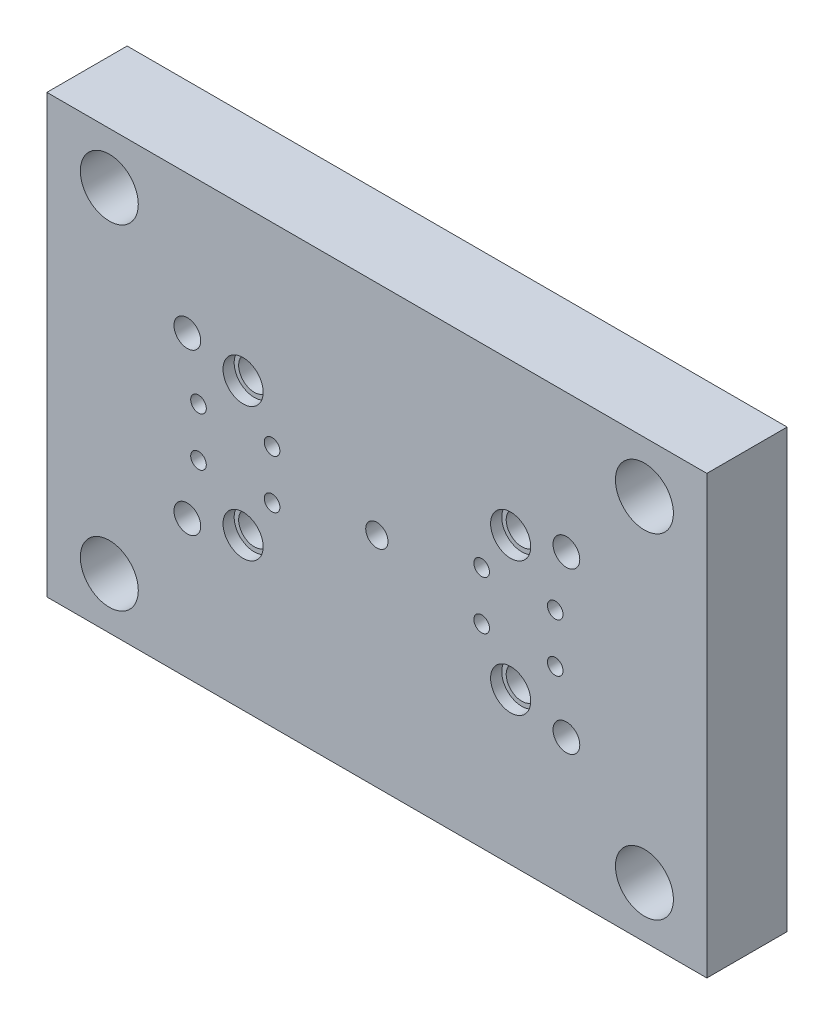
ISO-10303-21;
HEADER;
FILE_DESCRIPTION(('STEP AP214'),'2;1');
FILE_NAME('part.step','',(''),(''),'','','');
FILE_SCHEMA(('AUTOMOTIVE_DESIGN { 1 0 10303 214 1 1 1 1 }'));
ENDSEC;
DATA;
#1=APPLICATION_CONTEXT('core data for automotive mechanical design processes');
#2=APPLICATION_PROTOCOL_DEFINITION('international standard','automotive_design',2000,#1);
#3=PRODUCT_CONTEXT('',#1,'mechanical');
#4=PRODUCT('Part','Part','',(#3));
#5=PRODUCT_RELATED_PRODUCT_CATEGORY('part','',(#4));
#6=PRODUCT_DEFINITION_FORMATION('','',#4);
#7=PRODUCT_DEFINITION_CONTEXT('part definition',#1,'design');
#8=PRODUCT_DEFINITION('design','',#6,#7);
#9=PRODUCT_DEFINITION_SHAPE('','',#8);
#10=(LENGTH_UNIT() NAMED_UNIT(*) SI_UNIT(.MILLI.,.METRE.));
#11=(NAMED_UNIT(*) PLANE_ANGLE_UNIT() SI_UNIT($,.RADIAN.));
#12=(NAMED_UNIT(*) SI_UNIT($,.STERADIAN.) SOLID_ANGLE_UNIT());
#13=UNCERTAINTY_MEASURE_WITH_UNIT(LENGTH_MEASURE(1.E-05),#10,'distance_accuracy_value','');
#14=(GEOMETRIC_REPRESENTATION_CONTEXT(3) GLOBAL_UNCERTAINTY_ASSIGNED_CONTEXT((#13)) GLOBAL_UNIT_ASSIGNED_CONTEXT((#10,
#11,#12)) REPRESENTATION_CONTEXT('',''));
#15=CARTESIAN_POINT('',(0.,0.,0.));
#16=DIRECTION('',(0.,0.,1.));
#17=DIRECTION('',(1.,0.,0.));
#18=AXIS2_PLACEMENT_3D('',#15,#16,#17);
#19=CARTESIAN_POINT('',(-148.,-98.,-36.));
#20=DIRECTION('',(-1.,0.,0.));
#21=DIRECTION('',(0.,0.,1.));
#22=AXIS2_PLACEMENT_3D('',#19,#20,#21);
#23=PLANE('',#22);
#24=DIRECTION('',(0.,-1.,0.));
#25=VECTOR('',#24,1.);
#26=CARTESIAN_POINT('',(-148.,-98.,0.));
#27=LINE('',#26,#25);
#28=CARTESIAN_POINT('',(-148.,98.,0.));
#29=VERTEX_POINT('',#28);
#30=CARTESIAN_POINT('',(-148.,-98.,0.));
#31=VERTEX_POINT('',#30);
#32=EDGE_CURVE('E100',#29,#31,#27,.T.);
#33=ORIENTED_EDGE('',*,*,#32,.F.);
#34=DIRECTION('',(0.,0.,1.));
#35=VECTOR('',#34,1.);
#36=CARTESIAN_POINT('',(-148.,98.,-36.));
#37=LINE('',#36,#35);
#38=CARTESIAN_POINT('',(-148.,98.,-36.));
#39=VERTEX_POINT('',#38);
#40=EDGE_CURVE('E11',#39,#29,#37,.T.);
#41=ORIENTED_EDGE('',*,*,#40,.F.);
#42=DIRECTION('',(0.,-1.,0.));
#43=VECTOR('',#42,1.);
#44=CARTESIAN_POINT('',(-148.,-98.,-36.));
#45=LINE('',#44,#43);
#46=CARTESIAN_POINT('',(-148.,-98.,-36.));
#47=VERTEX_POINT('',#46);
#48=EDGE_CURVE('E93',#39,#47,#45,.T.);
#49=ORIENTED_EDGE('',*,*,#48,.T.);
#50=DIRECTION('',(0.,0.,1.));
#51=VECTOR('',#50,1.);
#52=CARTESIAN_POINT('',(-148.,-98.,-36.));
#53=LINE('',#52,#51);
#54=EDGE_CURVE('E38',#47,#31,#53,.T.);
#55=ORIENTED_EDGE('',*,*,#54,.T.);
#56=EDGE_LOOP('',(#33,#41,#49,#55));
#57=FACE_BOUND('',#56,.T.);
#58=ADVANCED_FACE('F35',(#57),#23,.T.);
#59=CARTESIAN_POINT('',(148.,98.,-36.));
#60=DIRECTION('',(0.,1.,0.));
#61=DIRECTION('',(0.,0.,1.));
#62=AXIS2_PLACEMENT_3D('',#59,#60,#61);
#63=PLANE('',#62);
#64=DIRECTION('',(-1.,0.,0.));
#65=VECTOR('',#64,1.);
#66=CARTESIAN_POINT('',(148.,98.,0.));
#67=LINE('',#66,#65);
#68=CARTESIAN_POINT('',(148.,98.,0.));
#69=VERTEX_POINT('',#68);
#70=EDGE_CURVE('E95',#69,#29,#67,.T.);
#71=ORIENTED_EDGE('',*,*,#70,.F.);
#72=DIRECTION('',(0.,0.,1.));
#73=VECTOR('',#72,1.);
#74=CARTESIAN_POINT('',(148.,98.,-36.));
#75=LINE('',#74,#73);
#76=CARTESIAN_POINT('',(148.,98.,-36.));
#77=VERTEX_POINT('',#76);
#78=EDGE_CURVE('E44',#77,#69,#75,.T.);
#79=ORIENTED_EDGE('',*,*,#78,.F.);
#80=DIRECTION('',(-1.,0.,0.));
#81=VECTOR('',#80,1.);
#82=CARTESIAN_POINT('',(148.,98.,-36.));
#83=LINE('',#82,#81);
#84=EDGE_CURVE('E90',#77,#39,#83,.T.);
#85=ORIENTED_EDGE('',*,*,#84,.T.);
#86=ORIENTED_EDGE('',*,*,#40,.T.);
#87=EDGE_LOOP('',(#71,#79,#85,#86));
#88=FACE_BOUND('',#87,.T.);
#89=ADVANCED_FACE('F111',(#88),#63,.T.);
#90=CARTESIAN_POINT('',(148.,-98.,-36.));
#91=DIRECTION('',(1.,0.,0.));
#92=DIRECTION('',(0.,0.,-1.));
#93=AXIS2_PLACEMENT_3D('',#90,#91,#92);
#94=PLANE('',#93);
#95=DIRECTION('',(0.,1.,0.));
#96=VECTOR('',#95,1.);
#97=CARTESIAN_POINT('',(148.,-98.,0.));
#98=LINE('',#97,#96);
#99=CARTESIAN_POINT('',(148.,-98.,0.));
#100=VERTEX_POINT('',#99);
#101=EDGE_CURVE('E85',#100,#69,#98,.T.);
#102=ORIENTED_EDGE('',*,*,#101,.F.);
#103=DIRECTION('',(0.,0.,1.));
#104=VECTOR('',#103,1.);
#105=CARTESIAN_POINT('',(148.,-98.,-36.));
#106=LINE('',#105,#104);
#107=CARTESIAN_POINT('',(148.,-98.,-36.));
#108=VERTEX_POINT('',#107);
#109=EDGE_CURVE('E80',#108,#100,#106,.T.);
#110=ORIENTED_EDGE('',*,*,#109,.F.);
#111=DIRECTION('',(0.,1.,0.));
#112=VECTOR('',#111,1.);
#113=CARTESIAN_POINT('',(148.,-98.,-36.));
#114=LINE('',#113,#112);
#115=EDGE_CURVE('E83',#108,#77,#114,.T.);
#116=ORIENTED_EDGE('',*,*,#115,.T.);
#117=ORIENTED_EDGE('',*,*,#78,.T.);
#118=EDGE_LOOP('',(#102,#110,#116,#117));
#119=FACE_BOUND('',#118,.T.);
#120=ADVANCED_FACE('F82',(#119),#94,.T.);
#121=CARTESIAN_POINT('',(148.,-98.,-36.));
#122=DIRECTION('',(0.,-1.,0.));
#123=DIRECTION('',(0.,0.,-1.));
#124=AXIS2_PLACEMENT_3D('',#121,#122,#123);
#125=PLANE('',#124);
#126=DIRECTION('',(1.,0.,0.));
#127=VECTOR('',#126,1.);
#128=CARTESIAN_POINT('',(148.,-98.,0.));
#129=LINE('',#128,#127);
#130=EDGE_CURVE('E103',#31,#100,#129,.T.);
#131=ORIENTED_EDGE('',*,*,#130,.F.);
#132=ORIENTED_EDGE('',*,*,#54,.F.);
#133=DIRECTION('',(1.,0.,0.));
#134=VECTOR('',#133,1.);
#135=CARTESIAN_POINT('',(148.,-98.,-36.));
#136=LINE('',#135,#134);
#137=EDGE_CURVE('E89',#47,#108,#136,.T.);
#138=ORIENTED_EDGE('',*,*,#137,.T.);
#139=ORIENTED_EDGE('',*,*,#109,.T.);
#140=EDGE_LOOP('',(#131,#132,#138,#139));
#141=FACE_BOUND('',#140,.T.);
#142=ADVANCED_FACE('F92',(#141),#125,.T.);
#143=CARTESIAN_POINT('',(-148.,98.,-36.));
#144=DIRECTION('',(0.,0.,1.));
#145=DIRECTION('',(1.,0.,0.));
#146=AXIS2_PLACEMENT_3D('',#143,#144,#145);
#147=PLANE('',#146);
#148=CARTESIAN_POINT('',(60.,30.,-36.));
#149=DIRECTION('',(0.,0.,1.));
#150=DIRECTION('',(1.,0.,0.));
#151=AXIS2_PLACEMENT_3D('',#148,#149,#150);
#152=CIRCLE('',#151,6.99999999999999);
#153=CARTESIAN_POINT('',(67.,30.,-36.));
#154=VERTEX_POINT('',#153);
#155=EDGE_CURVE('E263',#154,#154,#152,.T.);
#156=ORIENTED_EDGE('',*,*,#155,.T.);
#157=EDGE_LOOP('',(#156));
#158=FACE_BOUND('',#157,.T.);
#159=CARTESIAN_POINT('',(-60.,30.,-36.));
#160=DIRECTION('',(0.,0.,1.));
#161=DIRECTION('',(1.,0.,0.));
#162=AXIS2_PLACEMENT_3D('',#159,#160,#161);
#163=CIRCLE('',#162,6.99999999999999);
#164=CARTESIAN_POINT('',(-53.,30.,-36.));
#165=VERTEX_POINT('',#164);
#166=EDGE_CURVE('E274',#165,#165,#163,.T.);
#167=ORIENTED_EDGE('',*,*,#166,.T.);
#168=EDGE_LOOP('',(#167));
#169=FACE_BOUND('',#168,.T.);
#170=CARTESIAN_POINT('',(-60.,-30.,-36.));
#171=DIRECTION('',(0.,0.,1.));
#172=DIRECTION('',(1.,0.,0.));
#173=AXIS2_PLACEMENT_3D('',#170,#171,#172);
#174=CIRCLE('',#173,6.99999999999999);
#175=CARTESIAN_POINT('',(-53.,-30.,-36.));
#176=VERTEX_POINT('',#175);
#177=EDGE_CURVE('E286',#176,#176,#174,.T.);
#178=ORIENTED_EDGE('',*,*,#177,.T.);
#179=EDGE_LOOP('',(#178));
#180=FACE_BOUND('',#179,.T.);
#181=CARTESIAN_POINT('',(60.,-30.,-36.));
#182=DIRECTION('',(0.,0.,1.));
#183=DIRECTION('',(1.,0.,0.));
#184=AXIS2_PLACEMENT_3D('',#181,#182,#183);
#185=CIRCLE('',#184,6.99999999999999);
#186=CARTESIAN_POINT('',(67.,-30.,-36.));
#187=VERTEX_POINT('',#186);
#188=EDGE_CURVE('E298',#187,#187,#185,.T.);
#189=ORIENTED_EDGE('',*,*,#188,.T.);
#190=EDGE_LOOP('',(#189));
#191=FACE_BOUND('',#190,.T.);
#192=CARTESIAN_POINT('',(0.,0.,-36.));
#193=DIRECTION('',(0.,0.,1.));
#194=DIRECTION('',(1.,0.,0.));
#195=AXIS2_PLACEMENT_3D('',#192,#193,#194);
#196=CIRCLE('',#195,5.);
#197=CARTESIAN_POINT('',(5.00000000000003,0.,-36.));
#198=VERTEX_POINT('',#197);
#199=EDGE_CURVE('E302',#198,#198,#196,.T.);
#200=ORIENTED_EDGE('',*,*,#199,.T.);
#201=EDGE_LOOP('',(#200));
#202=FACE_BOUND('',#201,.T.);
#203=CARTESIAN_POINT('',(85.,-36.,-36.));
#204=DIRECTION('',(0.,0.,1.));
#205=DIRECTION('',(1.,0.,0.));
#206=AXIS2_PLACEMENT_3D('',#203,#204,#205);
#207=CIRCLE('',#206,6.);
#208=CARTESIAN_POINT('',(91.,-36.,-36.));
#209=VERTEX_POINT('',#208);
#210=EDGE_CURVE('E308',#209,#209,#207,.T.);
#211=ORIENTED_EDGE('',*,*,#210,.T.);
#212=EDGE_LOOP('',(#211));
#213=FACE_BOUND('',#212,.T.);
#214=CARTESIAN_POINT('',(85.,36.,-36.));
#215=DIRECTION('',(0.,0.,1.));
#216=DIRECTION('',(1.,0.,0.));
#217=AXIS2_PLACEMENT_3D('',#214,#215,#216);
#218=CIRCLE('',#217,6.);
#219=CARTESIAN_POINT('',(91.,36.,-36.));
#220=VERTEX_POINT('',#219);
#221=EDGE_CURVE('E314',#220,#220,#218,.T.);
#222=ORIENTED_EDGE('',*,*,#221,.T.);
#223=EDGE_LOOP('',(#222));
#224=FACE_BOUND('',#223,.T.);
#225=CARTESIAN_POINT('',(-85.,-36.,-36.));
#226=DIRECTION('',(0.,0.,1.));
#227=DIRECTION('',(1.,0.,0.));
#228=AXIS2_PLACEMENT_3D('',#225,#226,#227);
#229=CIRCLE('',#228,6.);
#230=CARTESIAN_POINT('',(-79.,-36.,-36.));
#231=VERTEX_POINT('',#230);
#232=EDGE_CURVE('E320',#231,#231,#229,.T.);
#233=ORIENTED_EDGE('',*,*,#232,.T.);
#234=EDGE_LOOP('',(#233));
#235=FACE_BOUND('',#234,.T.);
#236=CARTESIAN_POINT('',(-85.,36.,-36.));
#237=DIRECTION('',(0.,0.,1.));
#238=DIRECTION('',(1.,0.,0.));
#239=AXIS2_PLACEMENT_3D('',#236,#237,#238);
#240=CIRCLE('',#239,6.);
#241=CARTESIAN_POINT('',(-79.,36.,-36.));
#242=VERTEX_POINT('',#241);
#243=EDGE_CURVE('E326',#242,#242,#240,.T.);
#244=ORIENTED_EDGE('',*,*,#243,.T.);
#245=EDGE_LOOP('',(#244));
#246=FACE_BOUND('',#245,.T.);
#247=CARTESIAN_POINT('',(47.0000000000001,10.9399576507934,-36.));
#248=DIRECTION('',(0.,0.,1.));
#249=DIRECTION('',(-1.,0.,0.));
#250=AXIS2_PLACEMENT_3D('',#247,#248,#249);
#251=CIRCLE('',#250,3.5);
#252=CARTESIAN_POINT('',(43.5,10.9399576507934,-36.));
#253=VERTEX_POINT('',#252);
#254=EDGE_CURVE('E332',#253,#253,#251,.T.);
#255=ORIENTED_EDGE('',*,*,#254,.T.);
#256=EDGE_LOOP('',(#255));
#257=FACE_BOUND('',#256,.T.);
#258=CARTESIAN_POINT('',(80.0000000000001,10.9399576507934,-36.));
#259=DIRECTION('',(0.,0.,1.));
#260=DIRECTION('',(-1.,0.,0.));
#261=AXIS2_PLACEMENT_3D('',#258,#259,#260);
#262=CIRCLE('',#261,3.50000000000001);
#263=CARTESIAN_POINT('',(76.5000000000001,10.9399576507934,-36.));
#264=VERTEX_POINT('',#263);
#265=EDGE_CURVE('E338',#264,#264,#262,.T.);
#266=ORIENTED_EDGE('',*,*,#265,.T.);
#267=EDGE_LOOP('',(#266));
#268=FACE_BOUND('',#267,.T.);
#269=CARTESIAN_POINT('',(80.0000000000001,-10.9399576507934,-36.));
#270=DIRECTION('',(0.,0.,1.));
#271=DIRECTION('',(1.,0.,0.));
#272=AXIS2_PLACEMENT_3D('',#269,#270,#271);
#273=CIRCLE('',#272,3.50000000000001);
#274=CARTESIAN_POINT('',(83.5000000000001,-10.9399576507934,-36.));
#275=VERTEX_POINT('',#274);
#276=EDGE_CURVE('E344',#275,#275,#273,.T.);
#277=ORIENTED_EDGE('',*,*,#276,.T.);
#278=EDGE_LOOP('',(#277));
#279=FACE_BOUND('',#278,.T.);
#280=CARTESIAN_POINT('',(47.0000000000001,-10.9399576507934,-36.));
#281=DIRECTION('',(0.,0.,1.));
#282=DIRECTION('',(1.,0.,0.));
#283=AXIS2_PLACEMENT_3D('',#280,#281,#282);
#284=CIRCLE('',#283,3.5);
#285=CARTESIAN_POINT('',(50.5000000000001,-10.9399576507934,-36.));
#286=VERTEX_POINT('',#285);
#287=EDGE_CURVE('E350',#286,#286,#284,.T.);
#288=ORIENTED_EDGE('',*,*,#287,.T.);
#289=EDGE_LOOP('',(#288));
#290=FACE_BOUND('',#289,.T.);
#291=CARTESIAN_POINT('',(-47.,-10.9399576507934,-36.));
#292=DIRECTION('',(0.,0.,1.));
#293=DIRECTION('',(-1.,0.,0.));
#294=AXIS2_PLACEMENT_3D('',#291,#292,#293);
#295=CIRCLE('',#294,3.5);
#296=CARTESIAN_POINT('',(-50.5,-10.9399576507934,-36.));
#297=VERTEX_POINT('',#296);
#298=EDGE_CURVE('E356',#297,#297,#295,.T.);
#299=ORIENTED_EDGE('',*,*,#298,.T.);
#300=EDGE_LOOP('',(#299));
#301=FACE_BOUND('',#300,.T.);
#302=CARTESIAN_POINT('',(-80.,-10.9399576507934,-36.));
#303=DIRECTION('',(0.,0.,1.));
#304=DIRECTION('',(-1.,0.,0.));
#305=AXIS2_PLACEMENT_3D('',#302,#303,#304);
#306=CIRCLE('',#305,3.50000000000001);
#307=CARTESIAN_POINT('',(-83.5,-10.9399576507934,-36.));
#308=VERTEX_POINT('',#307);
#309=EDGE_CURVE('E362',#308,#308,#306,.T.);
#310=ORIENTED_EDGE('',*,*,#309,.T.);
#311=EDGE_LOOP('',(#310));
#312=FACE_BOUND('',#311,.T.);
#313=CARTESIAN_POINT('',(-80.,10.9399576507934,-36.));
#314=DIRECTION('',(0.,0.,1.));
#315=DIRECTION('',(1.,0.,0.));
#316=AXIS2_PLACEMENT_3D('',#313,#314,#315);
#317=CIRCLE('',#316,3.50000000000001);
#318=CARTESIAN_POINT('',(-76.5,10.9399576507934,-36.));
#319=VERTEX_POINT('',#318);
#320=EDGE_CURVE('E368',#319,#319,#317,.T.);
#321=ORIENTED_EDGE('',*,*,#320,.T.);
#322=EDGE_LOOP('',(#321));
#323=FACE_BOUND('',#322,.T.);
#324=CARTESIAN_POINT('',(-47.,10.9399576507934,-36.));
#325=DIRECTION('',(0.,0.,1.));
#326=DIRECTION('',(1.,0.,0.));
#327=AXIS2_PLACEMENT_3D('',#324,#325,#326);
#328=CIRCLE('',#327,3.5);
#329=CARTESIAN_POINT('',(-43.5,10.9399576507934,-36.));
#330=VERTEX_POINT('',#329);
#331=EDGE_CURVE('E374',#330,#330,#328,.T.);
#332=ORIENTED_EDGE('',*,*,#331,.T.);
#333=EDGE_LOOP('',(#332));
#334=FACE_BOUND('',#333,.T.);
#335=CARTESIAN_POINT('',(120.,-75.,-36.));
#336=DIRECTION('',(0.,0.,1.));
#337=DIRECTION('',(1.,0.,0.));
#338=AXIS2_PLACEMENT_3D('',#335,#336,#337);
#339=CIRCLE('',#338,13.);
#340=CARTESIAN_POINT('',(133.,-75.,-36.));
#341=VERTEX_POINT('',#340);
#342=EDGE_CURVE('E380',#341,#341,#339,.T.);
#343=ORIENTED_EDGE('',*,*,#342,.T.);
#344=EDGE_LOOP('',(#343));
#345=FACE_BOUND('',#344,.T.);
#346=CARTESIAN_POINT('',(120.,75.,-36.));
#347=DIRECTION('',(0.,0.,1.));
#348=DIRECTION('',(1.,0.,0.));
#349=AXIS2_PLACEMENT_3D('',#346,#347,#348);
#350=CIRCLE('',#349,13.);
#351=CARTESIAN_POINT('',(133.,75.,-36.));
#352=VERTEX_POINT('',#351);
#353=EDGE_CURVE('E386',#352,#352,#350,.T.);
#354=ORIENTED_EDGE('',*,*,#353,.T.);
#355=EDGE_LOOP('',(#354));
#356=FACE_BOUND('',#355,.T.);
#357=CARTESIAN_POINT('',(-120.,-75.,-36.));
#358=DIRECTION('',(0.,0.,1.));
#359=DIRECTION('',(1.,0.,0.));
#360=AXIS2_PLACEMENT_3D('',#357,#358,#359);
#361=CIRCLE('',#360,13.);
#362=CARTESIAN_POINT('',(-107.,-75.,-36.));
#363=VERTEX_POINT('',#362);
#364=EDGE_CURVE('E392',#363,#363,#361,.T.);
#365=ORIENTED_EDGE('',*,*,#364,.T.);
#366=EDGE_LOOP('',(#365));
#367=FACE_BOUND('',#366,.T.);
#368=CARTESIAN_POINT('',(-120.,75.,-36.));
#369=DIRECTION('',(0.,0.,1.));
#370=DIRECTION('',(1.,0.,0.));
#371=AXIS2_PLACEMENT_3D('',#368,#369,#370);
#372=CIRCLE('',#371,13.);
#373=CARTESIAN_POINT('',(-107.,75.,-36.));
#374=VERTEX_POINT('',#373);
#375=EDGE_CURVE('E104',#374,#374,#372,.T.);
#376=ORIENTED_EDGE('',*,*,#375,.T.);
#377=EDGE_LOOP('',(#376));
#378=FACE_BOUND('',#377,.T.);
#379=ORIENTED_EDGE('',*,*,#48,.F.);
#380=ORIENTED_EDGE('',*,*,#84,.F.);
#381=ORIENTED_EDGE('',*,*,#115,.F.);
#382=ORIENTED_EDGE('',*,*,#137,.F.);
#383=EDGE_LOOP('',(#379,#380,#381,#382));
#384=FACE_BOUND('',#383,.T.);
#385=ADVANCED_FACE('F88',(#158,#169,#180,#191,#202,#213,#224,#235,#246,#257,#268,#279,#290,#301,
#312,#323,#334,#345,#356,#367,#378,#384),#147,.F.);
#386=CARTESIAN_POINT('',(-148.,98.,0.));
#387=DIRECTION('',(0.,0.,1.));
#388=DIRECTION('',(1.,0.,0.));
#389=AXIS2_PLACEMENT_3D('',#386,#387,#388);
#390=PLANE('',#389);
#391=CARTESIAN_POINT('',(60.,30.,0.));
#392=DIRECTION('',(0.,0.,1.));
#393=DIRECTION('',(1.,0.,0.));
#394=AXIS2_PLACEMENT_3D('',#391,#392,#393);
#395=CIRCLE('',#394,8.99999999999999);
#396=CARTESIAN_POINT('',(69.,30.,0.));
#397=VERTEX_POINT('',#396);
#398=EDGE_CURVE('E256',#397,#397,#395,.T.);
#399=ORIENTED_EDGE('',*,*,#398,.F.);
#400=EDGE_LOOP('',(#399));
#401=FACE_BOUND('',#400,.T.);
#402=CARTESIAN_POINT('',(-60.,30.,0.));
#403=DIRECTION('',(0.,0.,1.));
#404=DIRECTION('',(1.,0.,0.));
#405=AXIS2_PLACEMENT_3D('',#402,#403,#404);
#406=CIRCLE('',#405,9.);
#407=CARTESIAN_POINT('',(-51.,30.,0.));
#408=VERTEX_POINT('',#407);
#409=EDGE_CURVE('E265',#408,#408,#406,.T.);
#410=ORIENTED_EDGE('',*,*,#409,.F.);
#411=EDGE_LOOP('',(#410));
#412=FACE_BOUND('',#411,.T.);
#413=CARTESIAN_POINT('',(-60.,-30.,0.));
#414=DIRECTION('',(0.,0.,1.));
#415=DIRECTION('',(1.,0.,0.));
#416=AXIS2_PLACEMENT_3D('',#413,#414,#415);
#417=CIRCLE('',#416,9.);
#418=CARTESIAN_POINT('',(-51.,-30.,0.));
#419=VERTEX_POINT('',#418);
#420=EDGE_CURVE('E277',#419,#419,#417,.T.);
#421=ORIENTED_EDGE('',*,*,#420,.F.);
#422=EDGE_LOOP('',(#421));
#423=FACE_BOUND('',#422,.T.);
#424=CARTESIAN_POINT('',(60.,-30.,0.));
#425=DIRECTION('',(0.,0.,1.));
#426=DIRECTION('',(1.,0.,0.));
#427=AXIS2_PLACEMENT_3D('',#424,#425,#426);
#428=CIRCLE('',#427,8.99999999999999);
#429=CARTESIAN_POINT('',(69.,-30.,0.));
#430=VERTEX_POINT('',#429);
#431=EDGE_CURVE('E289',#430,#430,#428,.T.);
#432=ORIENTED_EDGE('',*,*,#431,.F.);
#433=EDGE_LOOP('',(#432));
#434=FACE_BOUND('',#433,.T.);
#435=CARTESIAN_POINT('',(0.,0.,0.));
#436=DIRECTION('',(0.,0.,1.));
#437=DIRECTION('',(1.,0.,0.));
#438=AXIS2_PLACEMENT_3D('',#435,#436,#437);
#439=CIRCLE('',#438,5.);
#440=CARTESIAN_POINT('',(5.00000000000003,0.,0.));
#441=VERTEX_POINT('',#440);
#442=EDGE_CURVE('E301',#441,#441,#439,.T.);
#443=ORIENTED_EDGE('',*,*,#442,.F.);
#444=EDGE_LOOP('',(#443));
#445=FACE_BOUND('',#444,.T.);
#446=CARTESIAN_POINT('',(85.,-36.,0.));
#447=DIRECTION('',(0.,0.,1.));
#448=DIRECTION('',(1.,0.,0.));
#449=AXIS2_PLACEMENT_3D('',#446,#447,#448);
#450=CIRCLE('',#449,6.);
#451=CARTESIAN_POINT('',(91.,-36.,0.));
#452=VERTEX_POINT('',#451);
#453=EDGE_CURVE('E305',#452,#452,#450,.T.);
#454=ORIENTED_EDGE('',*,*,#453,.F.);
#455=EDGE_LOOP('',(#454));
#456=FACE_BOUND('',#455,.T.);
#457=CARTESIAN_POINT('',(85.,36.,0.));
#458=DIRECTION('',(0.,0.,1.));
#459=DIRECTION('',(1.,0.,0.));
#460=AXIS2_PLACEMENT_3D('',#457,#458,#459);
#461=CIRCLE('',#460,6.);
#462=CARTESIAN_POINT('',(91.,36.,0.));
#463=VERTEX_POINT('',#462);
#464=EDGE_CURVE('E311',#463,#463,#461,.T.);
#465=ORIENTED_EDGE('',*,*,#464,.F.);
#466=EDGE_LOOP('',(#465));
#467=FACE_BOUND('',#466,.T.);
#468=CARTESIAN_POINT('',(-85.,-36.,0.));
#469=DIRECTION('',(0.,0.,1.));
#470=DIRECTION('',(1.,0.,0.));
#471=AXIS2_PLACEMENT_3D('',#468,#469,#470);
#472=CIRCLE('',#471,6.);
#473=CARTESIAN_POINT('',(-79.,-36.,0.));
#474=VERTEX_POINT('',#473);
#475=EDGE_CURVE('E317',#474,#474,#472,.T.);
#476=ORIENTED_EDGE('',*,*,#475,.F.);
#477=EDGE_LOOP('',(#476));
#478=FACE_BOUND('',#477,.T.);
#479=CARTESIAN_POINT('',(-85.,36.,0.));
#480=DIRECTION('',(0.,0.,1.));
#481=DIRECTION('',(1.,0.,0.));
#482=AXIS2_PLACEMENT_3D('',#479,#480,#481);
#483=CIRCLE('',#482,6.);
#484=CARTESIAN_POINT('',(-79.,36.,0.));
#485=VERTEX_POINT('',#484);
#486=EDGE_CURVE('E323',#485,#485,#483,.T.);
#487=ORIENTED_EDGE('',*,*,#486,.F.);
#488=EDGE_LOOP('',(#487));
#489=FACE_BOUND('',#488,.T.);
#490=CARTESIAN_POINT('',(47.0000000000001,10.9399576507934,0.));
#491=DIRECTION('',(0.,0.,1.));
#492=DIRECTION('',(-1.,0.,0.));
#493=AXIS2_PLACEMENT_3D('',#490,#491,#492);
#494=CIRCLE('',#493,3.5);
#495=CARTESIAN_POINT('',(43.5,10.9399576507934,0.));
#496=VERTEX_POINT('',#495);
#497=EDGE_CURVE('E329',#496,#496,#494,.T.);
#498=ORIENTED_EDGE('',*,*,#497,.F.);
#499=EDGE_LOOP('',(#498));
#500=FACE_BOUND('',#499,.T.);
#501=CARTESIAN_POINT('',(80.0000000000001,10.9399576507934,0.));
#502=DIRECTION('',(0.,0.,1.));
#503=DIRECTION('',(-1.,0.,0.));
#504=AXIS2_PLACEMENT_3D('',#501,#502,#503);
#505=CIRCLE('',#504,3.50000000000001);
#506=CARTESIAN_POINT('',(76.5000000000001,10.9399576507934,0.));
#507=VERTEX_POINT('',#506);
#508=EDGE_CURVE('E335',#507,#507,#505,.T.);
#509=ORIENTED_EDGE('',*,*,#508,.F.);
#510=EDGE_LOOP('',(#509));
#511=FACE_BOUND('',#510,.T.);
#512=CARTESIAN_POINT('',(80.0000000000001,-10.9399576507934,0.));
#513=DIRECTION('',(0.,0.,1.));
#514=DIRECTION('',(1.,0.,0.));
#515=AXIS2_PLACEMENT_3D('',#512,#513,#514);
#516=CIRCLE('',#515,3.50000000000001);
#517=CARTESIAN_POINT('',(83.5000000000001,-10.9399576507934,0.));
#518=VERTEX_POINT('',#517);
#519=EDGE_CURVE('E341',#518,#518,#516,.T.);
#520=ORIENTED_EDGE('',*,*,#519,.F.);
#521=EDGE_LOOP('',(#520));
#522=FACE_BOUND('',#521,.T.);
#523=CARTESIAN_POINT('',(47.0000000000001,-10.9399576507934,0.));
#524=DIRECTION('',(0.,0.,1.));
#525=DIRECTION('',(1.,0.,0.));
#526=AXIS2_PLACEMENT_3D('',#523,#524,#525);
#527=CIRCLE('',#526,3.5);
#528=CARTESIAN_POINT('',(50.5000000000001,-10.9399576507934,0.));
#529=VERTEX_POINT('',#528);
#530=EDGE_CURVE('E347',#529,#529,#527,.T.);
#531=ORIENTED_EDGE('',*,*,#530,.F.);
#532=EDGE_LOOP('',(#531));
#533=FACE_BOUND('',#532,.T.);
#534=CARTESIAN_POINT('',(-47.,-10.9399576507934,0.));
#535=DIRECTION('',(0.,0.,1.));
#536=DIRECTION('',(-1.,0.,0.));
#537=AXIS2_PLACEMENT_3D('',#534,#535,#536);
#538=CIRCLE('',#537,3.5);
#539=CARTESIAN_POINT('',(-50.5,-10.9399576507934,0.));
#540=VERTEX_POINT('',#539);
#541=EDGE_CURVE('E353',#540,#540,#538,.T.);
#542=ORIENTED_EDGE('',*,*,#541,.F.);
#543=EDGE_LOOP('',(#542));
#544=FACE_BOUND('',#543,.T.);
#545=CARTESIAN_POINT('',(-80.,-10.9399576507934,0.));
#546=DIRECTION('',(0.,0.,1.));
#547=DIRECTION('',(-1.,0.,0.));
#548=AXIS2_PLACEMENT_3D('',#545,#546,#547);
#549=CIRCLE('',#548,3.50000000000001);
#550=CARTESIAN_POINT('',(-83.5,-10.9399576507934,0.));
#551=VERTEX_POINT('',#550);
#552=EDGE_CURVE('E359',#551,#551,#549,.T.);
#553=ORIENTED_EDGE('',*,*,#552,.F.);
#554=EDGE_LOOP('',(#553));
#555=FACE_BOUND('',#554,.T.);
#556=CARTESIAN_POINT('',(-80.,10.9399576507934,0.));
#557=DIRECTION('',(0.,0.,1.));
#558=DIRECTION('',(1.,0.,0.));
#559=AXIS2_PLACEMENT_3D('',#556,#557,#558);
#560=CIRCLE('',#559,3.50000000000001);
#561=CARTESIAN_POINT('',(-76.5,10.9399576507934,0.));
#562=VERTEX_POINT('',#561);
#563=EDGE_CURVE('E365',#562,#562,#560,.T.);
#564=ORIENTED_EDGE('',*,*,#563,.F.);
#565=EDGE_LOOP('',(#564));
#566=FACE_BOUND('',#565,.T.);
#567=CARTESIAN_POINT('',(-47.,10.9399576507934,0.));
#568=DIRECTION('',(0.,0.,1.));
#569=DIRECTION('',(1.,0.,0.));
#570=AXIS2_PLACEMENT_3D('',#567,#568,#569);
#571=CIRCLE('',#570,3.5);
#572=CARTESIAN_POINT('',(-43.5,10.9399576507934,0.));
#573=VERTEX_POINT('',#572);
#574=EDGE_CURVE('E371',#573,#573,#571,.T.);
#575=ORIENTED_EDGE('',*,*,#574,.F.);
#576=EDGE_LOOP('',(#575));
#577=FACE_BOUND('',#576,.T.);
#578=CARTESIAN_POINT('',(120.,-75.,0.));
#579=DIRECTION('',(0.,0.,1.));
#580=DIRECTION('',(1.,0.,0.));
#581=AXIS2_PLACEMENT_3D('',#578,#579,#580);
#582=CIRCLE('',#581,13.);
#583=CARTESIAN_POINT('',(133.,-75.,0.));
#584=VERTEX_POINT('',#583);
#585=EDGE_CURVE('E377',#584,#584,#582,.T.);
#586=ORIENTED_EDGE('',*,*,#585,.F.);
#587=EDGE_LOOP('',(#586));
#588=FACE_BOUND('',#587,.T.);
#589=CARTESIAN_POINT('',(120.,75.,0.));
#590=DIRECTION('',(0.,0.,1.));
#591=DIRECTION('',(1.,0.,0.));
#592=AXIS2_PLACEMENT_3D('',#589,#590,#591);
#593=CIRCLE('',#592,13.);
#594=CARTESIAN_POINT('',(133.,75.,0.));
#595=VERTEX_POINT('',#594);
#596=EDGE_CURVE('E383',#595,#595,#593,.T.);
#597=ORIENTED_EDGE('',*,*,#596,.F.);
#598=EDGE_LOOP('',(#597));
#599=FACE_BOUND('',#598,.T.);
#600=CARTESIAN_POINT('',(-120.,-75.,0.));
#601=DIRECTION('',(0.,0.,1.));
#602=DIRECTION('',(1.,0.,0.));
#603=AXIS2_PLACEMENT_3D('',#600,#601,#602);
#604=CIRCLE('',#603,13.);
#605=CARTESIAN_POINT('',(-107.,-75.,0.));
#606=VERTEX_POINT('',#605);
#607=EDGE_CURVE('E389',#606,#606,#604,.T.);
#608=ORIENTED_EDGE('',*,*,#607,.F.);
#609=EDGE_LOOP('',(#608));
#610=FACE_BOUND('',#609,.T.);
#611=CARTESIAN_POINT('',(-120.,75.,0.));
#612=DIRECTION('',(0.,0.,1.));
#613=DIRECTION('',(1.,0.,0.));
#614=AXIS2_PLACEMENT_3D('',#611,#612,#613);
#615=CIRCLE('',#614,13.);
#616=CARTESIAN_POINT('',(-107.,75.,0.));
#617=VERTEX_POINT('',#616);
#618=EDGE_CURVE('E395',#617,#617,#615,.T.);
#619=ORIENTED_EDGE('',*,*,#618,.F.);
#620=EDGE_LOOP('',(#619));
#621=FACE_BOUND('',#620,.T.);
#622=ORIENTED_EDGE('',*,*,#32,.T.);
#623=ORIENTED_EDGE('',*,*,#130,.T.);
#624=ORIENTED_EDGE('',*,*,#101,.T.);
#625=ORIENTED_EDGE('',*,*,#70,.T.);
#626=EDGE_LOOP('',(#622,#623,#624,#625));
#627=FACE_BOUND('',#626,.T.);
#628=ADVANCED_FACE('F110',(#401,#412,#423,#434,#445,#456,#467,#478,#489,#500,#511,#522,#533,
#544,#555,#566,#577,#588,#599,#610,#621,#627),#390,.T.);
#629=CARTESIAN_POINT('',(-120.,75.,-36.));
#630=DIRECTION('',(0.,0.,1.));
#631=DIRECTION('',(1.,0.,0.));
#632=AXIS2_PLACEMENT_3D('',#629,#630,#631);
#633=CYLINDRICAL_SURFACE('',#632,13.);
#634=ORIENTED_EDGE('',*,*,#375,.F.);
#635=EDGE_LOOP('',(#634));
#636=FACE_BOUND('',#635,.T.);
#637=ORIENTED_EDGE('',*,*,#618,.T.);
#638=EDGE_LOOP('',(#637));
#639=FACE_BOUND('',#638,.T.);
#640=ADVANCED_FACE('F129',(#636,#639),#633,.F.);
#641=CARTESIAN_POINT('',(-120.,-75.,-36.));
#642=DIRECTION('',(0.,0.,1.));
#643=DIRECTION('',(1.,0.,0.));
#644=AXIS2_PLACEMENT_3D('',#641,#642,#643);
#645=CYLINDRICAL_SURFACE('',#644,13.);
#646=ORIENTED_EDGE('',*,*,#364,.F.);
#647=EDGE_LOOP('',(#646));
#648=FACE_BOUND('',#647,.T.);
#649=ORIENTED_EDGE('',*,*,#607,.T.);
#650=EDGE_LOOP('',(#649));
#651=FACE_BOUND('',#650,.T.);
#652=ADVANCED_FACE('F136',(#648,#651),#645,.F.);
#653=CARTESIAN_POINT('',(120.,75.,-36.));
#654=DIRECTION('',(0.,0.,1.));
#655=DIRECTION('',(1.,0.,0.));
#656=AXIS2_PLACEMENT_3D('',#653,#654,#655);
#657=CYLINDRICAL_SURFACE('',#656,13.);
#658=ORIENTED_EDGE('',*,*,#353,.F.);
#659=EDGE_LOOP('',(#658));
#660=FACE_BOUND('',#659,.T.);
#661=ORIENTED_EDGE('',*,*,#596,.T.);
#662=EDGE_LOOP('',(#661));
#663=FACE_BOUND('',#662,.T.);
#664=ADVANCED_FACE('F140',(#660,#663),#657,.F.);
#665=CARTESIAN_POINT('',(120.,-75.,-36.));
#666=DIRECTION('',(0.,0.,1.));
#667=DIRECTION('',(1.,0.,0.));
#668=AXIS2_PLACEMENT_3D('',#665,#666,#667);
#669=CYLINDRICAL_SURFACE('',#668,13.);
#670=ORIENTED_EDGE('',*,*,#342,.F.);
#671=EDGE_LOOP('',(#670));
#672=FACE_BOUND('',#671,.T.);
#673=ORIENTED_EDGE('',*,*,#585,.T.);
#674=EDGE_LOOP('',(#673));
#675=FACE_BOUND('',#674,.T.);
#676=ADVANCED_FACE('F144',(#672,#675),#669,.F.);
#677=CARTESIAN_POINT('',(-47.,10.9399576507934,-36.));
#678=DIRECTION('',(0.,0.,1.));
#679=DIRECTION('',(1.,0.,0.));
#680=AXIS2_PLACEMENT_3D('',#677,#678,#679);
#681=CYLINDRICAL_SURFACE('',#680,3.5);
#682=ORIENTED_EDGE('',*,*,#331,.F.);
#683=EDGE_LOOP('',(#682));
#684=FACE_BOUND('',#683,.T.);
#685=ORIENTED_EDGE('',*,*,#574,.T.);
#686=EDGE_LOOP('',(#685));
#687=FACE_BOUND('',#686,.T.);
#688=ADVANCED_FACE('F148',(#684,#687),#681,.F.);
#689=CARTESIAN_POINT('',(-80.,10.9399576507934,-36.));
#690=DIRECTION('',(0.,0.,1.));
#691=DIRECTION('',(1.,0.,0.));
#692=AXIS2_PLACEMENT_3D('',#689,#690,#691);
#693=CYLINDRICAL_SURFACE('',#692,3.50000000000001);
#694=ORIENTED_EDGE('',*,*,#320,.F.);
#695=EDGE_LOOP('',(#694));
#696=FACE_BOUND('',#695,.T.);
#697=ORIENTED_EDGE('',*,*,#563,.T.);
#698=EDGE_LOOP('',(#697));
#699=FACE_BOUND('',#698,.T.);
#700=ADVANCED_FACE('F152',(#696,#699),#693,.F.);
#701=CARTESIAN_POINT('',(-80.,-10.9399576507934,-36.));
#702=DIRECTION('',(0.,0.,1.));
#703=DIRECTION('',(1.,0.,0.));
#704=AXIS2_PLACEMENT_3D('',#701,#702,#703);
#705=CYLINDRICAL_SURFACE('',#704,3.50000000000001);
#706=ORIENTED_EDGE('',*,*,#309,.F.);
#707=EDGE_LOOP('',(#706));
#708=FACE_BOUND('',#707,.T.);
#709=ORIENTED_EDGE('',*,*,#552,.T.);
#710=EDGE_LOOP('',(#709));
#711=FACE_BOUND('',#710,.T.);
#712=ADVANCED_FACE('F156',(#708,#711),#705,.F.);
#713=CARTESIAN_POINT('',(-47.,-10.9399576507934,-36.));
#714=DIRECTION('',(0.,0.,1.));
#715=DIRECTION('',(1.,0.,0.));
#716=AXIS2_PLACEMENT_3D('',#713,#714,#715);
#717=CYLINDRICAL_SURFACE('',#716,3.5);
#718=ORIENTED_EDGE('',*,*,#298,.F.);
#719=EDGE_LOOP('',(#718));
#720=FACE_BOUND('',#719,.T.);
#721=ORIENTED_EDGE('',*,*,#541,.T.);
#722=EDGE_LOOP('',(#721));
#723=FACE_BOUND('',#722,.T.);
#724=ADVANCED_FACE('F160',(#720,#723),#717,.F.);
#725=CARTESIAN_POINT('',(47.0000000000001,-10.9399576507934,-36.));
#726=DIRECTION('',(0.,0.,1.));
#727=DIRECTION('',(1.,0.,0.));
#728=AXIS2_PLACEMENT_3D('',#725,#726,#727);
#729=CYLINDRICAL_SURFACE('',#728,3.5);
#730=ORIENTED_EDGE('',*,*,#287,.F.);
#731=EDGE_LOOP('',(#730));
#732=FACE_BOUND('',#731,.T.);
#733=ORIENTED_EDGE('',*,*,#530,.T.);
#734=EDGE_LOOP('',(#733));
#735=FACE_BOUND('',#734,.T.);
#736=ADVANCED_FACE('F164',(#732,#735),#729,.F.);
#737=CARTESIAN_POINT('',(80.0000000000001,-10.9399576507934,-36.));
#738=DIRECTION('',(0.,0.,1.));
#739=DIRECTION('',(1.,0.,0.));
#740=AXIS2_PLACEMENT_3D('',#737,#738,#739);
#741=CYLINDRICAL_SURFACE('',#740,3.50000000000001);
#742=ORIENTED_EDGE('',*,*,#276,.F.);
#743=EDGE_LOOP('',(#742));
#744=FACE_BOUND('',#743,.T.);
#745=ORIENTED_EDGE('',*,*,#519,.T.);
#746=EDGE_LOOP('',(#745));
#747=FACE_BOUND('',#746,.T.);
#748=ADVANCED_FACE('F168',(#744,#747),#741,.F.);
#749=CARTESIAN_POINT('',(80.0000000000001,10.9399576507934,-36.));
#750=DIRECTION('',(0.,0.,1.));
#751=DIRECTION('',(1.,0.,0.));
#752=AXIS2_PLACEMENT_3D('',#749,#750,#751);
#753=CYLINDRICAL_SURFACE('',#752,3.50000000000001);
#754=ORIENTED_EDGE('',*,*,#265,.F.);
#755=EDGE_LOOP('',(#754));
#756=FACE_BOUND('',#755,.T.);
#757=ORIENTED_EDGE('',*,*,#508,.T.);
#758=EDGE_LOOP('',(#757));
#759=FACE_BOUND('',#758,.T.);
#760=ADVANCED_FACE('F172',(#756,#759),#753,.F.);
#761=CARTESIAN_POINT('',(47.0000000000001,10.9399576507934,-36.));
#762=DIRECTION('',(0.,0.,1.));
#763=DIRECTION('',(1.,0.,0.));
#764=AXIS2_PLACEMENT_3D('',#761,#762,#763);
#765=CYLINDRICAL_SURFACE('',#764,3.5);
#766=ORIENTED_EDGE('',*,*,#254,.F.);
#767=EDGE_LOOP('',(#766));
#768=FACE_BOUND('',#767,.T.);
#769=ORIENTED_EDGE('',*,*,#497,.T.);
#770=EDGE_LOOP('',(#769));
#771=FACE_BOUND('',#770,.T.);
#772=ADVANCED_FACE('F176',(#768,#771),#765,.F.);
#773=CARTESIAN_POINT('',(-85.,36.,-36.));
#774=DIRECTION('',(0.,0.,1.));
#775=DIRECTION('',(1.,0.,0.));
#776=AXIS2_PLACEMENT_3D('',#773,#774,#775);
#777=CYLINDRICAL_SURFACE('',#776,6.);
#778=ORIENTED_EDGE('',*,*,#243,.F.);
#779=EDGE_LOOP('',(#778));
#780=FACE_BOUND('',#779,.T.);
#781=ORIENTED_EDGE('',*,*,#486,.T.);
#782=EDGE_LOOP('',(#781));
#783=FACE_BOUND('',#782,.T.);
#784=ADVANCED_FACE('F180',(#780,#783),#777,.F.);
#785=CARTESIAN_POINT('',(-85.,-36.,-36.));
#786=DIRECTION('',(0.,0.,1.));
#787=DIRECTION('',(1.,0.,0.));
#788=AXIS2_PLACEMENT_3D('',#785,#786,#787);
#789=CYLINDRICAL_SURFACE('',#788,6.);
#790=ORIENTED_EDGE('',*,*,#232,.F.);
#791=EDGE_LOOP('',(#790));
#792=FACE_BOUND('',#791,.T.);
#793=ORIENTED_EDGE('',*,*,#475,.T.);
#794=EDGE_LOOP('',(#793));
#795=FACE_BOUND('',#794,.T.);
#796=ADVANCED_FACE('F184',(#792,#795),#789,.F.);
#797=CARTESIAN_POINT('',(85.,36.,-36.));
#798=DIRECTION('',(0.,0.,1.));
#799=DIRECTION('',(1.,0.,0.));
#800=AXIS2_PLACEMENT_3D('',#797,#798,#799);
#801=CYLINDRICAL_SURFACE('',#800,6.);
#802=ORIENTED_EDGE('',*,*,#221,.F.);
#803=EDGE_LOOP('',(#802));
#804=FACE_BOUND('',#803,.T.);
#805=ORIENTED_EDGE('',*,*,#464,.T.);
#806=EDGE_LOOP('',(#805));
#807=FACE_BOUND('',#806,.T.);
#808=ADVANCED_FACE('F188',(#804,#807),#801,.F.);
#809=CARTESIAN_POINT('',(85.,-36.,-36.));
#810=DIRECTION('',(0.,0.,1.));
#811=DIRECTION('',(1.,0.,0.));
#812=AXIS2_PLACEMENT_3D('',#809,#810,#811);
#813=CYLINDRICAL_SURFACE('',#812,6.);
#814=ORIENTED_EDGE('',*,*,#210,.F.);
#815=EDGE_LOOP('',(#814));
#816=FACE_BOUND('',#815,.T.);
#817=ORIENTED_EDGE('',*,*,#453,.T.);
#818=EDGE_LOOP('',(#817));
#819=FACE_BOUND('',#818,.T.);
#820=ADVANCED_FACE('F192',(#816,#819),#813,.F.);
#821=CARTESIAN_POINT('',(0.,0.,-36.));
#822=DIRECTION('',(0.,0.,1.));
#823=DIRECTION('',(1.,0.,0.));
#824=AXIS2_PLACEMENT_3D('',#821,#822,#823);
#825=CYLINDRICAL_SURFACE('',#824,5.);
#826=ORIENTED_EDGE('',*,*,#199,.F.);
#827=EDGE_LOOP('',(#826));
#828=FACE_BOUND('',#827,.T.);
#829=ORIENTED_EDGE('',*,*,#442,.T.);
#830=EDGE_LOOP('',(#829));
#831=FACE_BOUND('',#830,.T.);
#832=ADVANCED_FACE('F196',(#828,#831),#825,.F.);
#833=CARTESIAN_POINT('',(60.,-30.,0.));
#834=DIRECTION('',(0.,0.,1.));
#835=DIRECTION('',(1.,0.,0.));
#836=AXIS2_PLACEMENT_3D('',#833,#834,#835);
#837=CYLINDRICAL_SURFACE('',#836,7.);
#838=ORIENTED_EDGE('',*,*,#188,.F.);
#839=EDGE_LOOP('',(#838));
#840=FACE_BOUND('',#839,.T.);
#841=CARTESIAN_POINT('',(60.,-30.,-5.));
#842=DIRECTION('',(0.,0.,1.));
#843=DIRECTION('',(1.,0.,0.));
#844=AXIS2_PLACEMENT_3D('',#841,#842,#843);
#845=CIRCLE('',#844,7.00000000000001);
#846=CARTESIAN_POINT('',(67.,-30.,-5.));
#847=VERTEX_POINT('',#846);
#848=EDGE_CURVE('E295',#847,#847,#845,.T.);
#849=ORIENTED_EDGE('',*,*,#848,.T.);
#850=EDGE_LOOP('',(#849));
#851=FACE_BOUND('',#850,.T.);
#852=ADVANCED_FACE('F200',(#840,#851),#837,.F.);
#853=CARTESIAN_POINT('',(67.,-30.,-5.));
#854=DIRECTION('',(0.,0.,-1.));
#855=DIRECTION('',(-1.,0.,0.));
#856=AXIS2_PLACEMENT_3D('',#853,#854,#855);
#857=PLANE('',#856);
#858=ORIENTED_EDGE('',*,*,#848,.F.);
#859=EDGE_LOOP('',(#858));
#860=FACE_BOUND('',#859,.T.);
#861=CARTESIAN_POINT('',(60.,-30.,-5.));
#862=DIRECTION('',(0.,0.,1.));
#863=DIRECTION('',(1.,0.,0.));
#864=AXIS2_PLACEMENT_3D('',#861,#862,#863);
#865=CIRCLE('',#864,8.99999999999999);
#866=CARTESIAN_POINT('',(69.,-30.,-5.));
#867=VERTEX_POINT('',#866);
#868=EDGE_CURVE('E292',#867,#867,#865,.T.);
#869=ORIENTED_EDGE('',*,*,#868,.T.);
#870=EDGE_LOOP('',(#869));
#871=FACE_BOUND('',#870,.T.);
#872=ADVANCED_FACE('F204',(#860,#871),#857,.F.);
#873=CARTESIAN_POINT('',(60.,-30.,0.));
#874=DIRECTION('',(0.,0.,1.));
#875=DIRECTION('',(1.,0.,0.));
#876=AXIS2_PLACEMENT_3D('',#873,#874,#875);
#877=CYLINDRICAL_SURFACE('',#876,8.99999999999999);
#878=ORIENTED_EDGE('',*,*,#868,.F.);
#879=EDGE_LOOP('',(#878));
#880=FACE_BOUND('',#879,.T.);
#881=ORIENTED_EDGE('',*,*,#431,.T.);
#882=EDGE_LOOP('',(#881));
#883=FACE_BOUND('',#882,.T.);
#884=ADVANCED_FACE('F208',(#880,#883),#877,.F.);
#885=CARTESIAN_POINT('',(-60.,-30.,0.));
#886=DIRECTION('',(0.,0.,1.));
#887=DIRECTION('',(1.,0.,0.));
#888=AXIS2_PLACEMENT_3D('',#885,#886,#887);
#889=CYLINDRICAL_SURFACE('',#888,7.);
#890=ORIENTED_EDGE('',*,*,#177,.F.);
#891=EDGE_LOOP('',(#890));
#892=FACE_BOUND('',#891,.T.);
#893=CARTESIAN_POINT('',(-60.,-30.,-5.));
#894=DIRECTION('',(0.,0.,1.));
#895=DIRECTION('',(1.,0.,0.));
#896=AXIS2_PLACEMENT_3D('',#893,#894,#895);
#897=CIRCLE('',#896,7.00000000000001);
#898=CARTESIAN_POINT('',(-53.,-30.,-5.));
#899=VERTEX_POINT('',#898);
#900=EDGE_CURVE('E283',#899,#899,#897,.T.);
#901=ORIENTED_EDGE('',*,*,#900,.T.);
#902=EDGE_LOOP('',(#901));
#903=FACE_BOUND('',#902,.T.);
#904=ADVANCED_FACE('F212',(#892,#903),#889,.F.);
#905=CARTESIAN_POINT('',(-53.,-30.,-5.));
#906=DIRECTION('',(0.,0.,-1.));
#907=DIRECTION('',(-1.,0.,0.));
#908=AXIS2_PLACEMENT_3D('',#905,#906,#907);
#909=PLANE('',#908);
#910=ORIENTED_EDGE('',*,*,#900,.F.);
#911=EDGE_LOOP('',(#910));
#912=FACE_BOUND('',#911,.T.);
#913=CARTESIAN_POINT('',(-60.,-30.,-5.));
#914=DIRECTION('',(0.,0.,1.));
#915=DIRECTION('',(1.,0.,0.));
#916=AXIS2_PLACEMENT_3D('',#913,#914,#915);
#917=CIRCLE('',#916,9.);
#918=CARTESIAN_POINT('',(-51.,-30.,-5.));
#919=VERTEX_POINT('',#918);
#920=EDGE_CURVE('E280',#919,#919,#917,.T.);
#921=ORIENTED_EDGE('',*,*,#920,.T.);
#922=EDGE_LOOP('',(#921));
#923=FACE_BOUND('',#922,.T.);
#924=ADVANCED_FACE('F216',(#912,#923),#909,.F.);
#925=CARTESIAN_POINT('',(-60.,-30.,0.));
#926=DIRECTION('',(0.,0.,1.));
#927=DIRECTION('',(1.,0.,0.));
#928=AXIS2_PLACEMENT_3D('',#925,#926,#927);
#929=CYLINDRICAL_SURFACE('',#928,9.);
#930=ORIENTED_EDGE('',*,*,#920,.F.);
#931=EDGE_LOOP('',(#930));
#932=FACE_BOUND('',#931,.T.);
#933=ORIENTED_EDGE('',*,*,#420,.T.);
#934=EDGE_LOOP('',(#933));
#935=FACE_BOUND('',#934,.T.);
#936=ADVANCED_FACE('F220',(#932,#935),#929,.F.);
#937=CARTESIAN_POINT('',(-60.,30.,0.));
#938=DIRECTION('',(0.,0.,1.));
#939=DIRECTION('',(1.,0.,0.));
#940=AXIS2_PLACEMENT_3D('',#937,#938,#939);
#941=CYLINDRICAL_SURFACE('',#940,7.);
#942=ORIENTED_EDGE('',*,*,#166,.F.);
#943=EDGE_LOOP('',(#942));
#944=FACE_BOUND('',#943,.T.);
#945=CARTESIAN_POINT('',(-60.,30.,-5.));
#946=DIRECTION('',(0.,0.,1.));
#947=DIRECTION('',(1.,0.,0.));
#948=AXIS2_PLACEMENT_3D('',#945,#946,#947);
#949=CIRCLE('',#948,7.00000000000001);
#950=CARTESIAN_POINT('',(-53.,30.,-5.));
#951=VERTEX_POINT('',#950);
#952=EDGE_CURVE('E271',#951,#951,#949,.T.);
#953=ORIENTED_EDGE('',*,*,#952,.T.);
#954=EDGE_LOOP('',(#953));
#955=FACE_BOUND('',#954,.T.);
#956=ADVANCED_FACE('F224',(#944,#955),#941,.F.);
#957=CARTESIAN_POINT('',(-53.,30.,-5.));
#958=DIRECTION('',(0.,0.,-1.));
#959=DIRECTION('',(-1.,0.,0.));
#960=AXIS2_PLACEMENT_3D('',#957,#958,#959);
#961=PLANE('',#960);
#962=ORIENTED_EDGE('',*,*,#952,.F.);
#963=EDGE_LOOP('',(#962));
#964=FACE_BOUND('',#963,.T.);
#965=CARTESIAN_POINT('',(-60.,30.,-5.));
#966=DIRECTION('',(0.,0.,1.));
#967=DIRECTION('',(1.,0.,0.));
#968=AXIS2_PLACEMENT_3D('',#965,#966,#967);
#969=CIRCLE('',#968,9.);
#970=CARTESIAN_POINT('',(-51.,30.,-5.));
#971=VERTEX_POINT('',#970);
#972=EDGE_CURVE('E268',#971,#971,#969,.T.);
#973=ORIENTED_EDGE('',*,*,#972,.T.);
#974=EDGE_LOOP('',(#973));
#975=FACE_BOUND('',#974,.T.);
#976=ADVANCED_FACE('F228',(#964,#975),#961,.F.);
#977=CARTESIAN_POINT('',(-60.,30.,0.));
#978=DIRECTION('',(0.,0.,1.));
#979=DIRECTION('',(1.,0.,0.));
#980=AXIS2_PLACEMENT_3D('',#977,#978,#979);
#981=CYLINDRICAL_SURFACE('',#980,9.);
#982=ORIENTED_EDGE('',*,*,#972,.F.);
#983=EDGE_LOOP('',(#982));
#984=FACE_BOUND('',#983,.T.);
#985=ORIENTED_EDGE('',*,*,#409,.T.);
#986=EDGE_LOOP('',(#985));
#987=FACE_BOUND('',#986,.T.);
#988=ADVANCED_FACE('F232',(#984,#987),#981,.F.);
#989=CARTESIAN_POINT('',(60.,30.,0.));
#990=DIRECTION('',(0.,0.,1.));
#991=DIRECTION('',(1.,0.,0.));
#992=AXIS2_PLACEMENT_3D('',#989,#990,#991);
#993=CYLINDRICAL_SURFACE('',#992,7.);
#994=ORIENTED_EDGE('',*,*,#155,.F.);
#995=EDGE_LOOP('',(#994));
#996=FACE_BOUND('',#995,.T.);
#997=CARTESIAN_POINT('',(60.,30.,-5.));
#998=DIRECTION('',(0.,0.,1.));
#999=DIRECTION('',(1.,0.,0.));
#1000=AXIS2_PLACEMENT_3D('',#997,#998,#999);
#1001=CIRCLE('',#1000,7.00000000000001);
#1002=CARTESIAN_POINT('',(67.,30.,-5.));
#1003=VERTEX_POINT('',#1002);
#1004=EDGE_CURVE('E258',#1003,#1003,#1001,.T.);
#1005=ORIENTED_EDGE('',*,*,#1004,.T.);
#1006=EDGE_LOOP('',(#1005));
#1007=FACE_BOUND('',#1006,.T.);
#1008=ADVANCED_FACE('F236',(#996,#1007),#993,.F.);
#1009=CARTESIAN_POINT('',(67.,30.,-5.));
#1010=DIRECTION('',(0.,0.,-1.));
#1011=DIRECTION('',(-1.,0.,0.));
#1012=AXIS2_PLACEMENT_3D('',#1009,#1010,#1011);
#1013=PLANE('',#1012);
#1014=ORIENTED_EDGE('',*,*,#1004,.F.);
#1015=EDGE_LOOP('',(#1014));
#1016=FACE_BOUND('',#1015,.T.);
#1017=CARTESIAN_POINT('',(60.,30.,-5.));
#1018=DIRECTION('',(0.,0.,1.));
#1019=DIRECTION('',(1.,0.,0.));
#1020=AXIS2_PLACEMENT_3D('',#1017,#1018,#1019);
#1021=CIRCLE('',#1020,8.99999999999999);
#1022=CARTESIAN_POINT('',(69.,30.,-5.));
#1023=VERTEX_POINT('',#1022);
#1024=EDGE_CURVE('E253',#1023,#1023,#1021,.T.);
#1025=ORIENTED_EDGE('',*,*,#1024,.T.);
#1026=EDGE_LOOP('',(#1025));
#1027=FACE_BOUND('',#1026,.T.);
#1028=ADVANCED_FACE('F240',(#1016,#1027),#1013,.F.);
#1029=CARTESIAN_POINT('',(60.,30.,0.));
#1030=DIRECTION('',(0.,0.,1.));
#1031=DIRECTION('',(1.,0.,0.));
#1032=AXIS2_PLACEMENT_3D('',#1029,#1030,#1031);
#1033=CYLINDRICAL_SURFACE('',#1032,8.99999999999999);
#1034=ORIENTED_EDGE('',*,*,#1024,.F.);
#1035=EDGE_LOOP('',(#1034));
#1036=FACE_BOUND('',#1035,.T.);
#1037=ORIENTED_EDGE('',*,*,#398,.T.);
#1038=EDGE_LOOP('',(#1037));
#1039=FACE_BOUND('',#1038,.T.);
#1040=ADVANCED_FACE('F244',(#1036,#1039),#1033,.F.);
#1041=CLOSED_SHELL('',(#58,#89,#120,#142,#385,#628,#640,#652,#664,#676,#688,#700,#712,#724,#736,
#748,#760,#772,#784,#796,#808,#820,#832,#852,#872,#884,#904,#924,#936,#956,#976,#988,#1008,
#1028,#1040));
#1042=MANIFOLD_SOLID_BREP('B2',#1041);
#1043=ADVANCED_BREP_SHAPE_REPRESENTATION('',(#18,#1042),#14);
#1044=SHAPE_DEFINITION_REPRESENTATION(#9,#1043);
ENDSEC;
END-ISO-10303-21;
